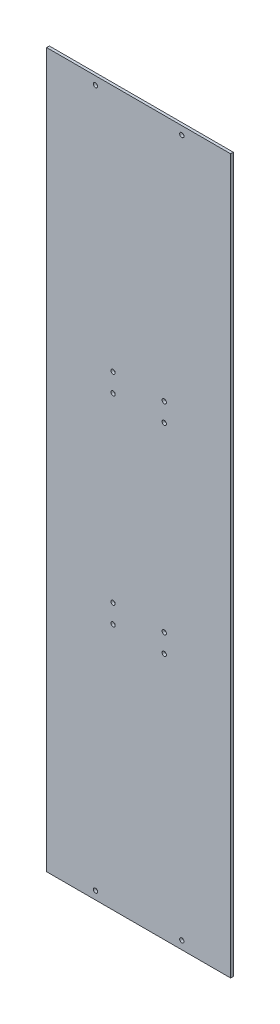
ISO-10303-21;
HEADER;
FILE_DESCRIPTION(('STEP AP214'),'2;1');
FILE_NAME('part.step','',(''),(''),'','','');
FILE_SCHEMA(('AUTOMOTIVE_DESIGN { 1 0 10303 214 1 1 1 1 }'));
ENDSEC;
DATA;
#1=APPLICATION_CONTEXT('core data for automotive mechanical design processes');
#2=APPLICATION_PROTOCOL_DEFINITION('international standard','automotive_design',2000,#1);
#3=PRODUCT_CONTEXT('',#1,'mechanical');
#4=PRODUCT('Part','Part','',(#3));
#5=PRODUCT_RELATED_PRODUCT_CATEGORY('part','',(#4));
#6=PRODUCT_DEFINITION_FORMATION('','',#4);
#7=PRODUCT_DEFINITION_CONTEXT('part definition',#1,'design');
#8=PRODUCT_DEFINITION('design','',#6,#7);
#9=PRODUCT_DEFINITION_SHAPE('','',#8);
#10=(LENGTH_UNIT() NAMED_UNIT(*) SI_UNIT(.MILLI.,.METRE.));
#11=(NAMED_UNIT(*) PLANE_ANGLE_UNIT() SI_UNIT($,.RADIAN.));
#12=(NAMED_UNIT(*) SI_UNIT($,.STERADIAN.) SOLID_ANGLE_UNIT());
#13=UNCERTAINTY_MEASURE_WITH_UNIT(LENGTH_MEASURE(1.E-05),#10,'distance_accuracy_value','');
#14=(GEOMETRIC_REPRESENTATION_CONTEXT(3) GLOBAL_UNCERTAINTY_ASSIGNED_CONTEXT((#13)) GLOBAL_UNIT_ASSIGNED_CONTEXT((#10,
#11,#12)) REPRESENTATION_CONTEXT('',''));
#15=CARTESIAN_POINT('',(0.,0.,0.));
#16=DIRECTION('',(0.,0.,1.));
#17=DIRECTION('',(1.,0.,0.));
#18=AXIS2_PLACEMENT_3D('',#15,#16,#17);
#19=CARTESIAN_POINT('',(53.82641,-208.915,1.5875));
#20=DIRECTION('',(-1.,0.,0.));
#21=DIRECTION('',(0.,0.,1.));
#22=AXIS2_PLACEMENT_3D('',#19,#20,#21);
#23=PLANE('',#22);
#24=DIRECTION('',(0.,1.,0.));
#25=VECTOR('',#24,1.);
#26=CARTESIAN_POINT('',(53.82641,-208.915,0.));
#27=LINE('',#26,#25);
#28=CARTESIAN_POINT('',(53.82641,-208.915,0.));
#29=VERTEX_POINT('',#28);
#30=CARTESIAN_POINT('',(53.82641,208.915,0.));
#31=VERTEX_POINT('',#30);
#32=EDGE_CURVE('E98',#29,#31,#27,.T.);
#33=ORIENTED_EDGE('',*,*,#32,.T.);
#34=DIRECTION('',(0.,0.,-1.));
#35=VECTOR('',#34,1.);
#36=CARTESIAN_POINT('',(53.82641,208.915,1.5875));
#37=LINE('',#36,#35);
#38=CARTESIAN_POINT('',(53.82641,208.915,1.5875));
#39=VERTEX_POINT('',#38);
#40=EDGE_CURVE('E11',#39,#31,#37,.T.);
#41=ORIENTED_EDGE('',*,*,#40,.F.);
#42=DIRECTION('',(0.,1.,0.));
#43=VECTOR('',#42,1.);
#44=CARTESIAN_POINT('',(53.82641,-208.915,1.5875));
#45=LINE('',#44,#43);
#46=CARTESIAN_POINT('',(53.82641,-208.915,1.5875));
#47=VERTEX_POINT('',#46);
#48=EDGE_CURVE('E86',#47,#39,#45,.T.);
#49=ORIENTED_EDGE('',*,*,#48,.F.);
#50=DIRECTION('',(0.,0.,-1.));
#51=VECTOR('',#50,1.);
#52=CARTESIAN_POINT('',(53.82641,-208.915,1.5875));
#53=LINE('',#52,#51);
#54=EDGE_CURVE('E94',#47,#29,#53,.T.);
#55=ORIENTED_EDGE('',*,*,#54,.T.);
#56=EDGE_LOOP('',(#33,#41,#49,#55));
#57=FACE_BOUND('',#56,.T.);
#58=ADVANCED_FACE('F35',(#57),#23,.F.);
#59=CARTESIAN_POINT('',(-53.82641,208.915,1.5875));
#60=DIRECTION('',(0.,-1.,0.));
#61=DIRECTION('',(0.,0.,-1.));
#62=AXIS2_PLACEMENT_3D('',#59,#60,#61);
#63=PLANE('',#62);
#64=DIRECTION('',(-1.,0.,0.));
#65=VECTOR('',#64,1.);
#66=CARTESIAN_POINT('',(-53.82641,208.915,0.));
#67=LINE('',#66,#65);
#68=CARTESIAN_POINT('',(-53.82641,208.915,0.));
#69=VERTEX_POINT('',#68);
#70=EDGE_CURVE('E90',#31,#69,#67,.T.);
#71=ORIENTED_EDGE('',*,*,#70,.T.);
#72=DIRECTION('',(0.,0.,-1.));
#73=VECTOR('',#72,1.);
#74=CARTESIAN_POINT('',(-53.82641,208.915,1.5875));
#75=LINE('',#74,#73);
#76=CARTESIAN_POINT('',(-53.82641,208.915,1.5875));
#77=VERTEX_POINT('',#76);
#78=EDGE_CURVE('E43',#77,#69,#75,.T.);
#79=ORIENTED_EDGE('',*,*,#78,.F.);
#80=DIRECTION('',(-1.,0.,0.));
#81=VECTOR('',#80,1.);
#82=CARTESIAN_POINT('',(-53.82641,208.915,1.5875));
#83=LINE('',#82,#81);
#84=EDGE_CURVE('E81',#39,#77,#83,.T.);
#85=ORIENTED_EDGE('',*,*,#84,.F.);
#86=ORIENTED_EDGE('',*,*,#40,.T.);
#87=EDGE_LOOP('',(#71,#79,#85,#86));
#88=FACE_BOUND('',#87,.T.);
#89=ADVANCED_FACE('F89',(#88),#63,.F.);
#90=CARTESIAN_POINT('',(-53.82641,-208.915,1.5875));
#91=DIRECTION('',(1.,0.,0.));
#92=DIRECTION('',(0.,0.,-1.));
#93=AXIS2_PLACEMENT_3D('',#90,#91,#92);
#94=PLANE('',#93);
#95=DIRECTION('',(0.,-1.,0.));
#96=VECTOR('',#95,1.);
#97=CARTESIAN_POINT('',(-53.82641,-208.915,0.));
#98=LINE('',#97,#96);
#99=CARTESIAN_POINT('',(-53.82641,-208.915,0.));
#100=VERTEX_POINT('',#99);
#101=EDGE_CURVE('E68',#69,#100,#98,.T.);
#102=ORIENTED_EDGE('',*,*,#101,.T.);
#103=DIRECTION('',(0.,0.,-1.));
#104=VECTOR('',#103,1.);
#105=CARTESIAN_POINT('',(-53.82641,-208.915,1.5875));
#106=LINE('',#105,#104);
#107=CARTESIAN_POINT('',(-53.82641,-208.915,1.5875));
#108=VERTEX_POINT('',#107);
#109=EDGE_CURVE('E91',#108,#100,#106,.T.);
#110=ORIENTED_EDGE('',*,*,#109,.F.);
#111=DIRECTION('',(0.,-1.,0.));
#112=VECTOR('',#111,1.);
#113=CARTESIAN_POINT('',(-53.82641,-208.915,1.5875));
#114=LINE('',#113,#112);
#115=EDGE_CURVE('E84',#77,#108,#114,.T.);
#116=ORIENTED_EDGE('',*,*,#115,.F.);
#117=ORIENTED_EDGE('',*,*,#78,.T.);
#118=EDGE_LOOP('',(#102,#110,#116,#117));
#119=FACE_BOUND('',#118,.T.);
#120=ADVANCED_FACE('F92',(#119),#94,.F.);
#121=CARTESIAN_POINT('',(-53.82641,-208.915,1.5875));
#122=DIRECTION('',(0.,1.,0.));
#123=DIRECTION('',(0.,0.,1.));
#124=AXIS2_PLACEMENT_3D('',#121,#122,#123);
#125=PLANE('',#124);
#126=DIRECTION('',(1.,0.,0.));
#127=VECTOR('',#126,1.);
#128=CARTESIAN_POINT('',(-53.82641,-208.915,0.));
#129=LINE('',#128,#127);
#130=EDGE_CURVE('E74',#100,#29,#129,.T.);
#131=ORIENTED_EDGE('',*,*,#130,.T.);
#132=ORIENTED_EDGE('',*,*,#54,.F.);
#133=DIRECTION('',(1.,0.,0.));
#134=VECTOR('',#133,1.);
#135=CARTESIAN_POINT('',(-53.82641,-208.915,1.5875));
#136=LINE('',#135,#134);
#137=EDGE_CURVE('E51',#108,#47,#136,.T.);
#138=ORIENTED_EDGE('',*,*,#137,.F.);
#139=ORIENTED_EDGE('',*,*,#109,.T.);
#140=EDGE_LOOP('',(#131,#132,#138,#139));
#141=FACE_BOUND('',#140,.T.);
#142=ADVANCED_FACE('F106',(#141),#125,.F.);
#143=CARTESIAN_POINT('',(0.,0.,1.5875));
#144=DIRECTION('',(0.,0.,-1.));
#145=DIRECTION('',(-1.,0.,0.));
#146=AXIS2_PLACEMENT_3D('',#143,#144,#145);
#147=PLANE('',#146);
#148=CARTESIAN_POINT('',(-14.986,64.008,1.5875));
#149=DIRECTION('',(0.,0.,1.));
#150=DIRECTION('',(-1.,0.,0.));
#151=AXIS2_PLACEMENT_3D('',#148,#149,#150);
#152=CIRCLE('',#151,1.26619);
#153=CARTESIAN_POINT('',(-16.25219,64.008,1.5875));
#154=VERTEX_POINT('',#153);
#155=EDGE_CURVE('E161',#154,#154,#152,.T.);
#156=ORIENTED_EDGE('',*,*,#155,.F.);
#157=EDGE_LOOP('',(#156));
#158=FACE_BOUND('',#157,.T.);
#159=CARTESIAN_POINT('',(-14.986,53.086,1.5875));
#160=DIRECTION('',(0.,0.,1.));
#161=DIRECTION('',(-1.,0.,0.));
#162=AXIS2_PLACEMENT_3D('',#159,#160,#161);
#163=CIRCLE('',#162,1.26619);
#164=CARTESIAN_POINT('',(-16.25219,53.086,1.5875));
#165=VERTEX_POINT('',#164);
#166=EDGE_CURVE('E155',#165,#165,#163,.T.);
#167=ORIENTED_EDGE('',*,*,#166,.F.);
#168=EDGE_LOOP('',(#167));
#169=FACE_BOUND('',#168,.T.);
#170=CARTESIAN_POINT('',(14.986,-53.086,1.5875));
#171=DIRECTION('',(0.,0.,1.));
#172=DIRECTION('',(-1.,0.,0.));
#173=AXIS2_PLACEMENT_3D('',#170,#171,#172);
#174=CIRCLE('',#173,1.26619);
#175=CARTESIAN_POINT('',(13.71981,-53.086,1.5875));
#176=VERTEX_POINT('',#175);
#177=EDGE_CURVE('E149',#176,#176,#174,.T.);
#178=ORIENTED_EDGE('',*,*,#177,.F.);
#179=EDGE_LOOP('',(#178));
#180=FACE_BOUND('',#179,.T.);
#181=CARTESIAN_POINT('',(-14.986,-53.086,1.5875));
#182=DIRECTION('',(0.,0.,1.));
#183=DIRECTION('',(1.,0.,0.));
#184=AXIS2_PLACEMENT_3D('',#181,#182,#183);
#185=CIRCLE('',#184,1.26619);
#186=CARTESIAN_POINT('',(-13.71981,-53.086,1.5875));
#187=VERTEX_POINT('',#186);
#188=EDGE_CURVE('E142',#187,#187,#185,.T.);
#189=ORIENTED_EDGE('',*,*,#188,.F.);
#190=EDGE_LOOP('',(#189));
#191=FACE_BOUND('',#190,.T.);
#192=CARTESIAN_POINT('',(14.986,64.008,1.5875));
#193=DIRECTION('',(0.,0.,1.));
#194=DIRECTION('',(1.,0.,0.));
#195=AXIS2_PLACEMENT_3D('',#192,#193,#194);
#196=CIRCLE('',#195,1.26619);
#197=CARTESIAN_POINT('',(16.25219,64.008,1.5875));
#198=VERTEX_POINT('',#197);
#199=EDGE_CURVE('E178',#198,#198,#196,.T.);
#200=ORIENTED_EDGE('',*,*,#199,.F.);
#201=EDGE_LOOP('',(#200));
#202=FACE_BOUND('',#201,.T.);
#203=CARTESIAN_POINT('',(14.986,-64.008,1.5875));
#204=DIRECTION('',(0.,0.,1.));
#205=DIRECTION('',(-1.,0.,0.));
#206=AXIS2_PLACEMENT_3D('',#203,#204,#205);
#207=CIRCLE('',#206,1.26619);
#208=CARTESIAN_POINT('',(13.71981,-64.008,1.5875));
#209=VERTEX_POINT('',#208);
#210=EDGE_CURVE('E172',#209,#209,#207,.T.);
#211=ORIENTED_EDGE('',*,*,#210,.F.);
#212=EDGE_LOOP('',(#211));
#213=FACE_BOUND('',#212,.T.);
#214=CARTESIAN_POINT('',(-14.986,-64.008,1.5875));
#215=DIRECTION('',(0.,0.,1.));
#216=DIRECTION('',(1.,0.,0.));
#217=AXIS2_PLACEMENT_3D('',#214,#215,#216);
#218=CIRCLE('',#217,1.26619);
#219=CARTESIAN_POINT('',(-13.71981,-64.008,1.5875));
#220=VERTEX_POINT('',#219);
#221=EDGE_CURVE('E166',#220,#220,#218,.T.);
#222=ORIENTED_EDGE('',*,*,#221,.F.);
#223=EDGE_LOOP('',(#222));
#224=FACE_BOUND('',#223,.T.);
#225=CARTESIAN_POINT('',(14.986,53.086,1.5875));
#226=DIRECTION('',(0.,0.,1.));
#227=DIRECTION('',(1.,0.,0.));
#228=AXIS2_PLACEMENT_3D('',#225,#226,#227);
#229=CIRCLE('',#228,1.26619);
#230=CARTESIAN_POINT('',(16.25219,53.086,1.5875));
#231=VERTEX_POINT('',#230);
#232=EDGE_CURVE('E136',#231,#231,#229,.T.);
#233=ORIENTED_EDGE('',*,*,#232,.F.);
#234=EDGE_LOOP('',(#233));
#235=FACE_BOUND('',#234,.T.);
#236=CARTESIAN_POINT('',(25.2844212790602,-204.1525,1.5875));
#237=DIRECTION('',(0.,0.,-1.));
#238=DIRECTION('',(1.,0.,0.));
#239=AXIS2_PLACEMENT_3D('',#236,#237,#238);
#240=CIRCLE('',#239,1.26619);
#241=CARTESIAN_POINT('',(26.5506112790602,-204.1525,1.5875));
#242=VERTEX_POINT('',#241);
#243=EDGE_CURVE('E115',#242,#242,#240,.T.);
#244=ORIENTED_EDGE('',*,*,#243,.T.);
#245=EDGE_LOOP('',(#244));
#246=FACE_BOUND('',#245,.T.);
#247=CARTESIAN_POINT('',(-25.2844212790602,204.1525,1.5875));
#248=DIRECTION('',(0.,0.,-1.));
#249=DIRECTION('',(1.,0.,0.));
#250=AXIS2_PLACEMENT_3D('',#247,#248,#249);
#251=CIRCLE('',#250,1.26619);
#252=CARTESIAN_POINT('',(-24.0182312790603,204.1525,1.5875));
#253=VERTEX_POINT('',#252);
#254=EDGE_CURVE('E121',#253,#253,#251,.T.);
#255=ORIENTED_EDGE('',*,*,#254,.T.);
#256=EDGE_LOOP('',(#255));
#257=FACE_BOUND('',#256,.T.);
#258=CARTESIAN_POINT('',(25.2844212790602,204.1525,1.5875));
#259=DIRECTION('',(0.,0.,-1.));
#260=DIRECTION('',(-1.,0.,0.));
#261=AXIS2_PLACEMENT_3D('',#258,#259,#260);
#262=CIRCLE('',#261,1.26619);
#263=CARTESIAN_POINT('',(24.0182312790602,204.1525,1.5875));
#264=VERTEX_POINT('',#263);
#265=EDGE_CURVE('E122',#264,#264,#262,.T.);
#266=ORIENTED_EDGE('',*,*,#265,.T.);
#267=EDGE_LOOP('',(#266));
#268=FACE_BOUND('',#267,.T.);
#269=CARTESIAN_POINT('',(-25.2844212790603,-204.1525,1.5875));
#270=DIRECTION('',(0.,0.,-1.));
#271=DIRECTION('',(-1.,0.,0.));
#272=AXIS2_PLACEMENT_3D('',#269,#270,#271);
#273=CIRCLE('',#272,1.26619);
#274=CARTESIAN_POINT('',(-26.5506112790603,-204.1525,1.5875));
#275=VERTEX_POINT('',#274);
#276=EDGE_CURVE('E101',#275,#275,#273,.T.);
#277=ORIENTED_EDGE('',*,*,#276,.T.);
#278=EDGE_LOOP('',(#277));
#279=FACE_BOUND('',#278,.T.);
#280=ORIENTED_EDGE('',*,*,#48,.T.);
#281=ORIENTED_EDGE('',*,*,#84,.T.);
#282=ORIENTED_EDGE('',*,*,#115,.T.);
#283=ORIENTED_EDGE('',*,*,#137,.T.);
#284=EDGE_LOOP('',(#280,#281,#282,#283));
#285=FACE_BOUND('',#284,.T.);
#286=ADVANCED_FACE('F82',(#158,#169,#180,#191,#202,#213,#224,#235,#246,#257,#268,#279,#285),
#147,.F.);
#287=CARTESIAN_POINT('',(0.,0.,0.));
#288=DIRECTION('',(0.,0.,-1.));
#289=DIRECTION('',(-1.,0.,0.));
#290=AXIS2_PLACEMENT_3D('',#287,#288,#289);
#291=PLANE('',#290);
#292=CARTESIAN_POINT('',(-14.986,64.008,0.));
#293=DIRECTION('',(0.,0.,1.));
#294=DIRECTION('',(-1.,0.,0.));
#295=AXIS2_PLACEMENT_3D('',#292,#293,#294);
#296=CIRCLE('',#295,1.26619);
#297=CARTESIAN_POINT('',(-16.25219,64.008,0.));
#298=VERTEX_POINT('',#297);
#299=EDGE_CURVE('E139',#298,#298,#296,.T.);
#300=ORIENTED_EDGE('',*,*,#299,.T.);
#301=EDGE_LOOP('',(#300));
#302=FACE_BOUND('',#301,.T.);
#303=CARTESIAN_POINT('',(-14.986,53.086,0.));
#304=DIRECTION('',(0.,0.,1.));
#305=DIRECTION('',(-1.,0.,0.));
#306=AXIS2_PLACEMENT_3D('',#303,#304,#305);
#307=CIRCLE('',#306,1.26619);
#308=CARTESIAN_POINT('',(-16.25219,53.086,0.));
#309=VERTEX_POINT('',#308);
#310=EDGE_CURVE('E158',#309,#309,#307,.T.);
#311=ORIENTED_EDGE('',*,*,#310,.T.);
#312=EDGE_LOOP('',(#311));
#313=FACE_BOUND('',#312,.T.);
#314=CARTESIAN_POINT('',(14.986,-53.086,0.));
#315=DIRECTION('',(0.,0.,1.));
#316=DIRECTION('',(-1.,0.,0.));
#317=AXIS2_PLACEMENT_3D('',#314,#315,#316);
#318=CIRCLE('',#317,1.26619);
#319=CARTESIAN_POINT('',(13.71981,-53.086,0.));
#320=VERTEX_POINT('',#319);
#321=EDGE_CURVE('E152',#320,#320,#318,.T.);
#322=ORIENTED_EDGE('',*,*,#321,.T.);
#323=EDGE_LOOP('',(#322));
#324=FACE_BOUND('',#323,.T.);
#325=CARTESIAN_POINT('',(-14.986,-53.086,0.));
#326=DIRECTION('',(0.,0.,1.));
#327=DIRECTION('',(1.,0.,0.));
#328=AXIS2_PLACEMENT_3D('',#325,#326,#327);
#329=CIRCLE('',#328,1.26619);
#330=CARTESIAN_POINT('',(-13.71981,-53.086,0.));
#331=VERTEX_POINT('',#330);
#332=EDGE_CURVE('E145',#331,#331,#329,.T.);
#333=ORIENTED_EDGE('',*,*,#332,.T.);
#334=EDGE_LOOP('',(#333));
#335=FACE_BOUND('',#334,.T.);
#336=CARTESIAN_POINT('',(14.986,64.008,0.));
#337=DIRECTION('',(0.,0.,1.));
#338=DIRECTION('',(1.,0.,0.));
#339=AXIS2_PLACEMENT_3D('',#336,#337,#338);
#340=CIRCLE('',#339,1.26619);
#341=CARTESIAN_POINT('',(16.25219,64.008,0.));
#342=VERTEX_POINT('',#341);
#343=EDGE_CURVE('E146',#342,#342,#340,.T.);
#344=ORIENTED_EDGE('',*,*,#343,.T.);
#345=EDGE_LOOP('',(#344));
#346=FACE_BOUND('',#345,.T.);
#347=CARTESIAN_POINT('',(14.986,-64.008,0.));
#348=DIRECTION('',(0.,0.,1.));
#349=DIRECTION('',(-1.,0.,0.));
#350=AXIS2_PLACEMENT_3D('',#347,#348,#349);
#351=CIRCLE('',#350,1.26619);
#352=CARTESIAN_POINT('',(13.71981,-64.008,0.));
#353=VERTEX_POINT('',#352);
#354=EDGE_CURVE('E175',#353,#353,#351,.T.);
#355=ORIENTED_EDGE('',*,*,#354,.T.);
#356=EDGE_LOOP('',(#355));
#357=FACE_BOUND('',#356,.T.);
#358=CARTESIAN_POINT('',(-14.986,-64.008,0.));
#359=DIRECTION('',(0.,0.,1.));
#360=DIRECTION('',(1.,0.,0.));
#361=AXIS2_PLACEMENT_3D('',#358,#359,#360);
#362=CIRCLE('',#361,1.26619);
#363=CARTESIAN_POINT('',(-13.71981,-64.008,0.));
#364=VERTEX_POINT('',#363);
#365=EDGE_CURVE('E169',#364,#364,#362,.T.);
#366=ORIENTED_EDGE('',*,*,#365,.T.);
#367=EDGE_LOOP('',(#366));
#368=FACE_BOUND('',#367,.T.);
#369=CARTESIAN_POINT('',(14.986,53.086,0.));
#370=DIRECTION('',(0.,0.,1.));
#371=DIRECTION('',(1.,0.,0.));
#372=AXIS2_PLACEMENT_3D('',#369,#370,#371);
#373=CIRCLE('',#372,1.26619);
#374=CARTESIAN_POINT('',(16.25219,53.086,0.));
#375=VERTEX_POINT('',#374);
#376=EDGE_CURVE('E133',#375,#375,#373,.T.);
#377=ORIENTED_EDGE('',*,*,#376,.T.);
#378=EDGE_LOOP('',(#377));
#379=FACE_BOUND('',#378,.T.);
#380=CARTESIAN_POINT('',(25.2844212790602,-204.1525,0.));
#381=DIRECTION('',(0.,0.,-1.));
#382=DIRECTION('',(1.,0.,0.));
#383=AXIS2_PLACEMENT_3D('',#380,#381,#382);
#384=CIRCLE('',#383,1.26619);
#385=CARTESIAN_POINT('',(26.5506112790602,-204.1525,0.));
#386=VERTEX_POINT('',#385);
#387=EDGE_CURVE('E125',#386,#386,#384,.T.);
#388=ORIENTED_EDGE('',*,*,#387,.F.);
#389=EDGE_LOOP('',(#388));
#390=FACE_BOUND('',#389,.T.);
#391=CARTESIAN_POINT('',(-25.2844212790602,204.1525,0.));
#392=DIRECTION('',(0.,0.,-1.));
#393=DIRECTION('',(1.,0.,0.));
#394=AXIS2_PLACEMENT_3D('',#391,#392,#393);
#395=CIRCLE('',#394,1.26619);
#396=CARTESIAN_POINT('',(-24.0182312790603,204.1525,0.));
#397=VERTEX_POINT('',#396);
#398=EDGE_CURVE('E118',#397,#397,#395,.T.);
#399=ORIENTED_EDGE('',*,*,#398,.F.);
#400=EDGE_LOOP('',(#399));
#401=FACE_BOUND('',#400,.T.);
#402=CARTESIAN_POINT('',(25.2844212790602,204.1525,0.));
#403=DIRECTION('',(0.,0.,-1.));
#404=DIRECTION('',(-1.,0.,0.));
#405=AXIS2_PLACEMENT_3D('',#402,#403,#404);
#406=CIRCLE('',#405,1.26619);
#407=CARTESIAN_POINT('',(24.0182312790602,204.1525,0.));
#408=VERTEX_POINT('',#407);
#409=EDGE_CURVE('E130',#408,#408,#406,.T.);
#410=ORIENTED_EDGE('',*,*,#409,.F.);
#411=EDGE_LOOP('',(#410));
#412=FACE_BOUND('',#411,.T.);
#413=CARTESIAN_POINT('',(-25.2844212790603,-204.1525,0.));
#414=DIRECTION('',(0.,0.,-1.));
#415=DIRECTION('',(-1.,0.,0.));
#416=AXIS2_PLACEMENT_3D('',#413,#414,#415);
#417=CIRCLE('',#416,1.26619);
#418=CARTESIAN_POINT('',(-26.5506112790603,-204.1525,0.));
#419=VERTEX_POINT('',#418);
#420=EDGE_CURVE('E112',#419,#419,#417,.T.);
#421=ORIENTED_EDGE('',*,*,#420,.F.);
#422=EDGE_LOOP('',(#421));
#423=FACE_BOUND('',#422,.T.);
#424=ORIENTED_EDGE('',*,*,#32,.F.);
#425=ORIENTED_EDGE('',*,*,#130,.F.);
#426=ORIENTED_EDGE('',*,*,#101,.F.);
#427=ORIENTED_EDGE('',*,*,#70,.F.);
#428=EDGE_LOOP('',(#424,#425,#426,#427));
#429=FACE_BOUND('',#428,.T.);
#430=ADVANCED_FACE('F109',(#302,#313,#324,#335,#346,#357,#368,#379,#390,#401,#412,#423,#429),
#291,.T.);
#431=CARTESIAN_POINT('',(-25.2844212790603,-204.1525,1.5875));
#432=DIRECTION('',(0.,0.,-1.));
#433=DIRECTION('',(-1.,0.,0.));
#434=AXIS2_PLACEMENT_3D('',#431,#432,#433);
#435=CYLINDRICAL_SURFACE('',#434,1.26619);
#436=ORIENTED_EDGE('',*,*,#276,.F.);
#437=EDGE_LOOP('',(#436));
#438=FACE_BOUND('',#437,.T.);
#439=ORIENTED_EDGE('',*,*,#420,.T.);
#440=EDGE_LOOP('',(#439));
#441=FACE_BOUND('',#440,.T.);
#442=ADVANCED_FACE('F212',(#438,#441),#435,.F.);
#443=CARTESIAN_POINT('',(25.2844212790602,204.1525,1.5875));
#444=DIRECTION('',(0.,0.,-1.));
#445=DIRECTION('',(-1.,0.,0.));
#446=AXIS2_PLACEMENT_3D('',#443,#444,#445);
#447=CYLINDRICAL_SURFACE('',#446,1.26619);
#448=ORIENTED_EDGE('',*,*,#265,.F.);
#449=EDGE_LOOP('',(#448));
#450=FACE_BOUND('',#449,.T.);
#451=ORIENTED_EDGE('',*,*,#409,.T.);
#452=EDGE_LOOP('',(#451));
#453=FACE_BOUND('',#452,.T.);
#454=ADVANCED_FACE('F215',(#450,#453),#447,.F.);
#455=CARTESIAN_POINT('',(-25.2844212790602,204.1525,1.5875));
#456=DIRECTION('',(0.,0.,-1.));
#457=DIRECTION('',(-1.,0.,0.));
#458=AXIS2_PLACEMENT_3D('',#455,#456,#457);
#459=CYLINDRICAL_SURFACE('',#458,1.26619);
#460=ORIENTED_EDGE('',*,*,#254,.F.);
#461=EDGE_LOOP('',(#460));
#462=FACE_BOUND('',#461,.T.);
#463=ORIENTED_EDGE('',*,*,#398,.T.);
#464=EDGE_LOOP('',(#463));
#465=FACE_BOUND('',#464,.T.);
#466=ADVANCED_FACE('F338',(#462,#465),#459,.F.);
#467=CARTESIAN_POINT('',(25.2844212790602,-204.1525,1.5875));
#468=DIRECTION('',(0.,0.,-1.));
#469=DIRECTION('',(-1.,0.,0.));
#470=AXIS2_PLACEMENT_3D('',#467,#468,#469);
#471=CYLINDRICAL_SURFACE('',#470,1.26619);
#472=ORIENTED_EDGE('',*,*,#243,.F.);
#473=EDGE_LOOP('',(#472));
#474=FACE_BOUND('',#473,.T.);
#475=ORIENTED_EDGE('',*,*,#387,.T.);
#476=EDGE_LOOP('',(#475));
#477=FACE_BOUND('',#476,.T.);
#478=ADVANCED_FACE('F250',(#474,#477),#471,.F.);
#479=CARTESIAN_POINT('',(14.986,53.086,0.));
#480=DIRECTION('',(0.,0.,1.));
#481=DIRECTION('',(1.,0.,0.));
#482=AXIS2_PLACEMENT_3D('',#479,#480,#481);
#483=CYLINDRICAL_SURFACE('',#482,1.26619);
#484=ORIENTED_EDGE('',*,*,#376,.F.);
#485=EDGE_LOOP('',(#484));
#486=FACE_BOUND('',#485,.T.);
#487=ORIENTED_EDGE('',*,*,#232,.T.);
#488=EDGE_LOOP('',(#487));
#489=FACE_BOUND('',#488,.T.);
#490=ADVANCED_FACE('F260',(#486,#489),#483,.F.);
#491=CARTESIAN_POINT('',(-14.986,-64.008,0.));
#492=DIRECTION('',(0.,0.,1.));
#493=DIRECTION('',(1.,0.,0.));
#494=AXIS2_PLACEMENT_3D('',#491,#492,#493);
#495=CYLINDRICAL_SURFACE('',#494,1.26619);
#496=ORIENTED_EDGE('',*,*,#365,.F.);
#497=EDGE_LOOP('',(#496));
#498=FACE_BOUND('',#497,.T.);
#499=ORIENTED_EDGE('',*,*,#221,.T.);
#500=EDGE_LOOP('',(#499));
#501=FACE_BOUND('',#500,.T.);
#502=ADVANCED_FACE('F265',(#498,#501),#495,.F.);
#503=CARTESIAN_POINT('',(14.986,-64.008,0.));
#504=DIRECTION('',(0.,0.,1.));
#505=DIRECTION('',(1.,0.,0.));
#506=AXIS2_PLACEMENT_3D('',#503,#504,#505);
#507=CYLINDRICAL_SURFACE('',#506,1.26619);
#508=ORIENTED_EDGE('',*,*,#354,.F.);
#509=EDGE_LOOP('',(#508));
#510=FACE_BOUND('',#509,.T.);
#511=ORIENTED_EDGE('',*,*,#210,.T.);
#512=EDGE_LOOP('',(#511));
#513=FACE_BOUND('',#512,.T.);
#514=ADVANCED_FACE('F190',(#510,#513),#507,.F.);
#515=CARTESIAN_POINT('',(14.986,64.008,0.));
#516=DIRECTION('',(0.,0.,1.));
#517=DIRECTION('',(1.,0.,0.));
#518=AXIS2_PLACEMENT_3D('',#515,#516,#517);
#519=CYLINDRICAL_SURFACE('',#518,1.26619);
#520=ORIENTED_EDGE('',*,*,#343,.F.);
#521=EDGE_LOOP('',(#520));
#522=FACE_BOUND('',#521,.T.);
#523=ORIENTED_EDGE('',*,*,#199,.T.);
#524=EDGE_LOOP('',(#523));
#525=FACE_BOUND('',#524,.T.);
#526=ADVANCED_FACE('F186',(#522,#525),#519,.F.);
#527=CARTESIAN_POINT('',(-14.986,-53.086,0.));
#528=DIRECTION('',(0.,0.,1.));
#529=DIRECTION('',(1.,0.,0.));
#530=AXIS2_PLACEMENT_3D('',#527,#528,#529);
#531=CYLINDRICAL_SURFACE('',#530,1.26619);
#532=ORIENTED_EDGE('',*,*,#332,.F.);
#533=EDGE_LOOP('',(#532));
#534=FACE_BOUND('',#533,.T.);
#535=ORIENTED_EDGE('',*,*,#188,.T.);
#536=EDGE_LOOP('',(#535));
#537=FACE_BOUND('',#536,.T.);
#538=ADVANCED_FACE('F189',(#534,#537),#531,.F.);
#539=CARTESIAN_POINT('',(14.986,-53.086,0.));
#540=DIRECTION('',(0.,0.,1.));
#541=DIRECTION('',(1.,0.,0.));
#542=AXIS2_PLACEMENT_3D('',#539,#540,#541);
#543=CYLINDRICAL_SURFACE('',#542,1.26619);
#544=ORIENTED_EDGE('',*,*,#321,.F.);
#545=EDGE_LOOP('',(#544));
#546=FACE_BOUND('',#545,.T.);
#547=ORIENTED_EDGE('',*,*,#177,.T.);
#548=EDGE_LOOP('',(#547));
#549=FACE_BOUND('',#548,.T.);
#550=ADVANCED_FACE('F299',(#546,#549),#543,.F.);
#551=CARTESIAN_POINT('',(-14.986,53.086,0.));
#552=DIRECTION('',(0.,0.,1.));
#553=DIRECTION('',(1.,0.,0.));
#554=AXIS2_PLACEMENT_3D('',#551,#552,#553);
#555=CYLINDRICAL_SURFACE('',#554,1.26619);
#556=ORIENTED_EDGE('',*,*,#310,.F.);
#557=EDGE_LOOP('',(#556));
#558=FACE_BOUND('',#557,.T.);
#559=ORIENTED_EDGE('',*,*,#166,.T.);
#560=EDGE_LOOP('',(#559));
#561=FACE_BOUND('',#560,.T.);
#562=ADVANCED_FACE('F309',(#558,#561),#555,.F.);
#563=CARTESIAN_POINT('',(-14.986,64.008,0.));
#564=DIRECTION('',(0.,0.,1.));
#565=DIRECTION('',(1.,0.,0.));
#566=AXIS2_PLACEMENT_3D('',#563,#564,#565);
#567=CYLINDRICAL_SURFACE('',#566,1.26619);
#568=ORIENTED_EDGE('',*,*,#299,.F.);
#569=EDGE_LOOP('',(#568));
#570=FACE_BOUND('',#569,.T.);
#571=ORIENTED_EDGE('',*,*,#155,.T.);
#572=EDGE_LOOP('',(#571));
#573=FACE_BOUND('',#572,.T.);
#574=ADVANCED_FACE('F319',(#570,#573),#567,.F.);
#575=CLOSED_SHELL('',(#58,#89,#120,#142,#286,#430,#442,#454,#466,#478,#490,#502,#514,#526,#538,
#550,#562,#574));
#576=MANIFOLD_SOLID_BREP('B2',#575);
#577=ADVANCED_BREP_SHAPE_REPRESENTATION('',(#18,#576),#14);
#578=SHAPE_DEFINITION_REPRESENTATION(#9,#577);
ENDSEC;
END-ISO-10303-21;
